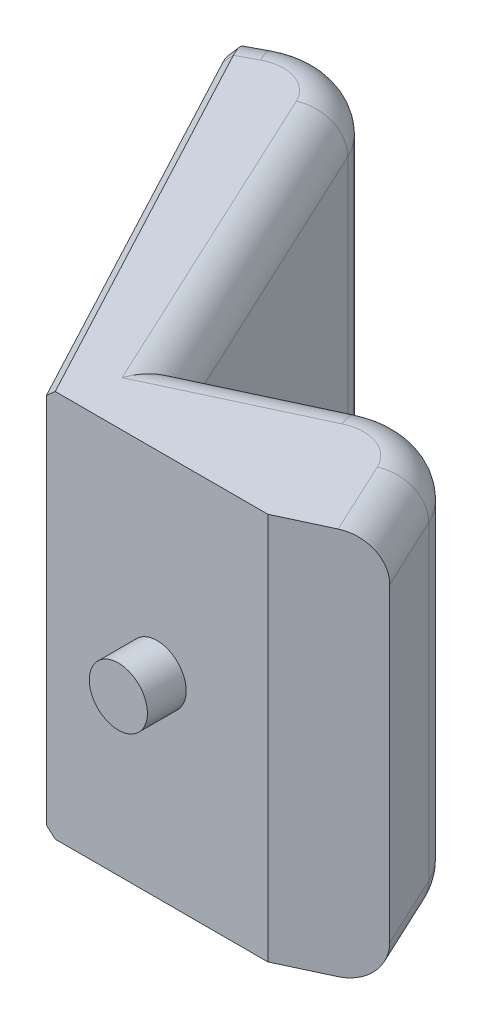
ISO-10303-21;
HEADER;
FILE_DESCRIPTION(('STEP AP214'),'2;1');
FILE_NAME('part.step','',(''),(''),'','','');
FILE_SCHEMA(('AUTOMOTIVE_DESIGN { 1 0 10303 214 1 1 1 1 }'));
ENDSEC;
DATA;
#1=APPLICATION_CONTEXT('core data for automotive mechanical design processes');
#2=APPLICATION_PROTOCOL_DEFINITION('international standard','automotive_design',2000,#1);
#3=PRODUCT_CONTEXT('',#1,'mechanical');
#4=PRODUCT('Part','Part','',(#3));
#5=PRODUCT_RELATED_PRODUCT_CATEGORY('part','',(#4));
#6=PRODUCT_DEFINITION_FORMATION('','',#4);
#7=PRODUCT_DEFINITION_CONTEXT('part definition',#1,'design');
#8=PRODUCT_DEFINITION('design','',#6,#7);
#9=PRODUCT_DEFINITION_SHAPE('','',#8);
#10=(LENGTH_UNIT() NAMED_UNIT(*) SI_UNIT(.MILLI.,.METRE.));
#11=(NAMED_UNIT(*) PLANE_ANGLE_UNIT() SI_UNIT($,.RADIAN.));
#12=(NAMED_UNIT(*) SI_UNIT($,.STERADIAN.) SOLID_ANGLE_UNIT());
#13=UNCERTAINTY_MEASURE_WITH_UNIT(LENGTH_MEASURE(1.E-05),#10,'distance_accuracy_value','');
#14=(GEOMETRIC_REPRESENTATION_CONTEXT(3) GLOBAL_UNCERTAINTY_ASSIGNED_CONTEXT((#13)) GLOBAL_UNIT_ASSIGNED_CONTEXT((#10,
#11,#12)) REPRESENTATION_CONTEXT('',''));
#15=CARTESIAN_POINT('',(0.,0.,0.));
#16=DIRECTION('',(0.,0.,1.));
#17=DIRECTION('',(1.,0.,0.));
#18=AXIS2_PLACEMENT_3D('',#15,#16,#17);
#19=CARTESIAN_POINT('',(-49.9268318921868,50.,-109.36052100333));
#20=DIRECTION('',(0.469329852369791,0.,0.883022927037883));
#21=DIRECTION('',(0.883022927037883,0.,-0.469329852369791));
#22=AXIS2_PLACEMENT_3D('',#19,#20,#21);
#23=PLANE('',#22);
#24=DIRECTION('',(-0.883022927037883,0.,0.469329852369791));
#25=VECTOR('',#24,1.);
#26=CARTESIAN_POINT('',(-49.9268318921868,-40.,-109.36052100333));
#27=LINE('',#26,#25);
#28=CARTESIAN_POINT('',(-49.9268318921868,-40.,-109.36052100333));
#29=VERTEX_POINT('',#28);
#30=CARTESIAN_POINT('',(-54.5535364302991,-40.,-106.901410949286));
#31=VERTEX_POINT('',#30);
#32=EDGE_CURVE('E222',#29,#31,#27,.T.);
#33=ORIENTED_EDGE('',*,*,#32,.T.);
#34=DIRECTION('',(0.,1.,0.));
#35=VECTOR('',#34,1.);
#36=CARTESIAN_POINT('',(-54.5535364302991,50.,-106.901410949286));
#37=LINE('',#36,#35);
#38=CARTESIAN_POINT('',(-54.5535364302991,40.,-106.901410949286));
#39=VERTEX_POINT('',#38);
#40=EDGE_CURVE('E317',#31,#39,#37,.T.);
#41=ORIENTED_EDGE('',*,*,#40,.T.);
#42=DIRECTION('',(-0.883022927037883,0.,0.469329852369791));
#43=VECTOR('',#42,1.);
#44=CARTESIAN_POINT('',(-49.9268318921868,40.,-109.36052100333));
#45=LINE('',#44,#43);
#46=CARTESIAN_POINT('',(-49.9268318921868,40.,-109.36052100333));
#47=VERTEX_POINT('',#46);
#48=EDGE_CURVE('E220',#39,#47,#45,.F.);
#49=ORIENTED_EDGE('',*,*,#48,.T.);
#50=DIRECTION('',(0.,-1.,0.));
#51=VECTOR('',#50,1.);
#52=CARTESIAN_POINT('',(-49.9268318921868,50.,-109.36052100333));
#53=LINE('',#52,#51);
#54=EDGE_CURVE('E192',#47,#29,#53,.T.);
#55=ORIENTED_EDGE('',*,*,#54,.T.);
#56=EDGE_LOOP('',(#33,#41,#49,#55));
#57=FACE_BOUND('',#56,.T.);
#58=ADVANCED_FACE('F32',(#57),#23,.F.);
#59=CARTESIAN_POINT('',(-56.3195822843749,50.,-105.962751244546));
#60=DIRECTION('',(0.883022927037883,0.,-0.469329852369791));
#61=DIRECTION('',(-0.469329852369791,0.,-0.883022927037883));
#62=AXIS2_PLACEMENT_3D('',#59,#60,#61);
#63=PLANE('',#62);
#64=DIRECTION('',(0.,-1.,0.));
#65=VECTOR('',#64,1.);
#66=CARTESIAN_POINT('',(0.,50.,0.));
#67=LINE('',#66,#65);
#68=CARTESIAN_POINT('',(0.,48.,0.));
#69=VERTEX_POINT('',#68);
#70=CARTESIAN_POINT('',(0.,-48.,0.));
#71=VERTEX_POINT('',#70);
#72=EDGE_CURVE('E185',#69,#71,#67,.T.);
#73=ORIENTED_EDGE('',*,*,#72,.F.);
#74=DIRECTION('',(-0.469329852369791,0.,-0.883022927037883));
#75=VECTOR('',#74,1.);
#76=CARTESIAN_POINT('',(-51.626283760677,48.,-97.1325219741671));
#77=LINE('',#76,#75);
#78=CARTESIAN_POINT('',(-51.626283760677,47.9999999999999,-97.1325219741671));
#79=VERTEX_POINT('',#78);
#80=EDGE_CURVE('E313',#69,#79,#77,.T.);
#81=ORIENTED_EDGE('',*,*,#80,.T.);
#82=CARTESIAN_POINT('',(-51.626283760677,40.,-97.1325219741671));
#83=DIRECTION('',(0.883022927037883,0.,-0.469329852369791));
#84=DIRECTION('',(-0.469329852369791,0.,-0.883022927037883));
#85=AXIS2_PLACEMENT_3D('',#82,#83,#84);
#86=CIRCLE('',#85,7.99999999999995);
#87=CARTESIAN_POINT('',(-55.3809225796353,40.,-104.19670539047));
#88=VERTEX_POINT('',#87);
#89=EDGE_CURVE('E311',#79,#88,#86,.F.);
#90=ORIENTED_EDGE('',*,*,#89,.T.);
#91=DIRECTION('',(0.,-1.,0.));
#92=VECTOR('',#91,1.);
#93=CARTESIAN_POINT('',(-55.3809225796353,50.,-104.19670539047));
#94=LINE('',#93,#92);
#95=CARTESIAN_POINT('',(-55.3809225796353,-40.,-104.19670539047));
#96=VERTEX_POINT('',#95);
#97=EDGE_CURVE('E309',#88,#96,#94,.T.);
#98=ORIENTED_EDGE('',*,*,#97,.T.);
#99=CARTESIAN_POINT('',(-51.626283760677,-40.,-97.1325219741671));
#100=DIRECTION('',(0.883022927037883,0.,-0.469329852369791));
#101=DIRECTION('',(-0.469329852369791,0.,-0.883022927037883));
#102=AXIS2_PLACEMENT_3D('',#99,#100,#101);
#103=CIRCLE('',#102,7.99999999999997);
#104=CARTESIAN_POINT('',(-51.626283760677,-48.,-97.1325219741671));
#105=VERTEX_POINT('',#104);
#106=EDGE_CURVE('E305',#96,#105,#103,.F.);
#107=ORIENTED_EDGE('',*,*,#106,.T.);
#108=DIRECTION('',(0.469329852369791,0.,0.883022927037883));
#109=VECTOR('',#108,1.);
#110=CARTESIAN_POINT('',(-56.3195822843749,-48.,-105.962751244546));
#111=LINE('',#110,#109);
#112=EDGE_CURVE('E307',#105,#71,#111,.T.);
#113=ORIENTED_EDGE('',*,*,#112,.T.);
#114=EDGE_LOOP('',(#73,#81,#90,#98,#107,#113));
#115=FACE_BOUND('',#114,.T.);
#116=ADVANCED_FACE('F341',(#115),#63,.F.);
#117=CARTESIAN_POINT('',(0.,50.,0.));
#118=DIRECTION('',(0.,0.,-1.));
#119=DIRECTION('',(-1.,0.,0.));
#120=AXIS2_PLACEMENT_3D('',#117,#118,#119);
#121=PLANE('',#120);
#122=CARTESIAN_POINT('',(28.55,0.,0.));
#123=DIRECTION('',(0.,0.,-1.));
#124=DIRECTION('',(-1.,0.,0.));
#125=AXIS2_PLACEMENT_3D('',#122,#123,#124);
#126=CIRCLE('',#125,7.5);
#127=CARTESIAN_POINT('',(21.05,0.,0.));
#128=VERTEX_POINT('',#127);
#129=EDGE_CURVE('E217',#128,#128,#126,.F.);
#130=ORIENTED_EDGE('',*,*,#129,.F.);
#131=EDGE_LOOP('',(#130));
#132=FACE_BOUND('',#131,.T.);
#133=DIRECTION('',(1.,0.,0.));
#134=VECTOR('',#133,1.);
#135=CARTESIAN_POINT('',(0.,50.,0.));
#136=LINE('',#135,#134);
#137=CARTESIAN_POINT('',(2.26494685331565,50.,0.));
#138=VERTEX_POINT('',#137);
#139=CARTESIAN_POINT('',(57.1,50.,0.));
#140=VERTEX_POINT('',#139);
#141=EDGE_CURVE('E165',#138,#140,#136,.T.);
#142=ORIENTED_EDGE('',*,*,#141,.F.);
#143=DIRECTION('',(-0.749588649437998,-0.66190396330111,0.));
#144=VECTOR('',#143,1.);
#145=CARTESIAN_POINT('',(3.61018174373285,51.1878732504897,0.));
#146=LINE('',#145,#144);
#147=EDGE_CURVE('E303',#138,#69,#146,.T.);
#148=ORIENTED_EDGE('',*,*,#147,.T.);
#149=ORIENTED_EDGE('',*,*,#72,.T.);
#150=DIRECTION('',(-0.749588649437998,0.66190396330111,0.));
#151=VECTOR('',#150,1.);
#152=CARTESIAN_POINT('',(-31.6450239270206,-20.0567183457786,0.));
#153=LINE('',#152,#151);
#154=CARTESIAN_POINT('',(2.26494685331567,-50.,0.));
#155=VERTEX_POINT('',#154);
#156=EDGE_CURVE('E301',#71,#155,#153,.F.);
#157=ORIENTED_EDGE('',*,*,#156,.T.);
#158=DIRECTION('',(1.,0.,0.));
#159=VECTOR('',#158,1.);
#160=CARTESIAN_POINT('',(0.,-50.,0.));
#161=LINE('',#160,#159);
#162=CARTESIAN_POINT('',(57.1,-50.,0.));
#163=VERTEX_POINT('',#162);
#164=EDGE_CURVE('E181',#155,#163,#161,.T.);
#165=ORIENTED_EDGE('',*,*,#164,.T.);
#166=DIRECTION('',(0.,-1.,0.));
#167=VECTOR('',#166,1.);
#168=CARTESIAN_POINT('',(57.1,50.,0.));
#169=LINE('',#168,#167);
#170=EDGE_CURVE('E179',#140,#163,#169,.T.);
#171=ORIENTED_EDGE('',*,*,#170,.F.);
#172=EDGE_LOOP('',(#142,#148,#149,#157,#165,#171));
#173=FACE_BOUND('',#172,.T.);
#174=ADVANCED_FACE('F180',(#132,#173),#121,.F.);
#175=CARTESIAN_POINT('',(57.1,50.,0.));
#176=DIRECTION('',(-0.422618261740701,0.,-0.906307787036649));
#177=DIRECTION('',(-0.906307787036649,0.,0.422618261740701));
#178=AXIS2_PLACEMENT_3D('',#175,#176,#177);
#179=PLANE('',#178);
#180=DIRECTION('',(0.906307787036649,0.,-0.422618261740701));
#181=VECTOR('',#180,1.);
#182=CARTESIAN_POINT('',(57.1,-50.,0.));
#183=LINE('',#182,#181);
#184=CARTESIAN_POINT('',(69.481991334729,-50.,-5.77381738259299));
#185=VERTEX_POINT('',#184);
#186=EDGE_CURVE('E176',#163,#185,#183,.T.);
#187=ORIENTED_EDGE('',*,*,#186,.T.);
#188=CARTESIAN_POINT('',(69.481991334729,-40.,-5.77381738259299));
#189=DIRECTION('',(-0.422618261740701,0.,-0.906307787036649));
#190=DIRECTION('',(-0.906307787036649,0.,0.422618261740701));
#191=AXIS2_PLACEMENT_3D('',#188,#189,#190);
#192=CIRCLE('',#191,10.);
#193=CARTESIAN_POINT('',(78.5450692050955,-40.,-10.));
#194=VERTEX_POINT('',#193);
#195=EDGE_CURVE('E245',#185,#194,#192,.F.);
#196=ORIENTED_EDGE('',*,*,#195,.T.);
#197=DIRECTION('',(0.,-1.,0.));
#198=VECTOR('',#197,1.);
#199=CARTESIAN_POINT('',(78.5450692050955,50.,-10.));
#200=LINE('',#199,#198);
#201=CARTESIAN_POINT('',(78.5450692050955,40.,-10.));
#202=VERTEX_POINT('',#201);
#203=EDGE_CURVE('E186',#202,#194,#200,.T.);
#204=ORIENTED_EDGE('',*,*,#203,.F.);
#205=CARTESIAN_POINT('',(69.481991334729,40.,-5.77381738259299));
#206=DIRECTION('',(-0.422618261740701,0.,-0.906307787036649));
#207=DIRECTION('',(-0.906307787036649,0.,0.422618261740701));
#208=AXIS2_PLACEMENT_3D('',#205,#206,#207);
#209=CIRCLE('',#208,10.);
#210=CARTESIAN_POINT('',(69.481991334729,50.,-5.77381738259299));
#211=VERTEX_POINT('',#210);
#212=EDGE_CURVE('E191',#202,#211,#209,.F.);
#213=ORIENTED_EDGE('',*,*,#212,.T.);
#214=DIRECTION('',(0.906307787036649,0.,-0.422618261740701));
#215=VECTOR('',#214,1.);
#216=CARTESIAN_POINT('',(57.1,50.,0.));
#217=LINE('',#216,#215);
#218=EDGE_CURVE('E171',#140,#211,#217,.T.);
#219=ORIENTED_EDGE('',*,*,#218,.F.);
#220=ORIENTED_EDGE('',*,*,#170,.T.);
#221=EDGE_LOOP('',(#187,#196,#204,#213,#219,#220));
#222=FACE_BOUND('',#221,.T.);
#223=ADVANCED_FACE('F188',(#222),#179,.F.);
#224=CARTESIAN_POINT('',(78.5450692050955,50.,-10.));
#225=DIRECTION('',(-0.906307787036649,0.,0.422618261740701));
#226=DIRECTION('',(0.422618261740701,0.,0.906307787036649));
#227=AXIS2_PLACEMENT_3D('',#224,#225,#226);
#228=PLANE('',#227);
#229=ORIENTED_EDGE('',*,*,#203,.T.);
#230=DIRECTION('',(-0.422618261740701,0.,-0.906307787036649));
#231=VECTOR('',#230,1.);
#232=CARTESIAN_POINT('',(78.5450692050955,-40.,-10.));
#233=LINE('',#232,#231);
#234=CARTESIAN_POINT('',(69.7457164699851,-40.,-28.8702728364488));
#235=VERTEX_POINT('',#234);
#236=EDGE_CURVE('E242',#194,#235,#233,.T.);
#237=ORIENTED_EDGE('',*,*,#236,.T.);
#238=DIRECTION('',(0.,-1.,0.));
#239=VECTOR('',#238,1.);
#240=CARTESIAN_POINT('',(69.7457164699851,50.,-28.8702728364488));
#241=LINE('',#240,#239);
#242=CARTESIAN_POINT('',(69.7457164699851,40.,-28.8702728364488));
#243=VERTEX_POINT('',#242);
#244=EDGE_CURVE('E210',#243,#235,#241,.T.);
#245=ORIENTED_EDGE('',*,*,#244,.F.);
#246=DIRECTION('',(-0.422618261740701,0.,-0.906307787036649));
#247=VECTOR('',#246,1.);
#248=CARTESIAN_POINT('',(78.5450692050955,40.,-10.));
#249=LINE('',#248,#247);
#250=EDGE_CURVE('E240',#243,#202,#249,.F.);
#251=ORIENTED_EDGE('',*,*,#250,.T.);
#252=EDGE_LOOP('',(#229,#237,#245,#251));
#253=FACE_BOUND('',#252,.T.);
#254=ADVANCED_FACE('F403',(#253),#228,.F.);
#255=CARTESIAN_POINT('',(51.0481741294805,50.,-20.1514656543941));
#256=DIRECTION('',(0.,-1.,0.));
#257=DIRECTION('',(0.,0.,-1.));
#258=AXIS2_PLACEMENT_3D('',#255,#256,#257);
#259=CYLINDRICAL_SURFACE('',#258,20.6304553573791);
#260=ORIENTED_EDGE('',*,*,#244,.T.);
#261=CARTESIAN_POINT('',(51.0481741294805,-40.,-20.1514656543941));
#262=DIRECTION('',(0.,1.,0.));
#263=DIRECTION('',(0.,0.,1.));
#264=AXIS2_PLACEMENT_3D('',#261,#262,#263);
#265=CIRCLE('',#264,20.6304553573791);
#266=CARTESIAN_POINT('',(42.3293669474258,-40.,-38.8490079948987));
#267=VERTEX_POINT('',#266);
#268=EDGE_CURVE('E269',#235,#267,#265,.T.);
#269=ORIENTED_EDGE('',*,*,#268,.T.);
#270=DIRECTION('',(0.,-1.,0.));
#271=VECTOR('',#270,1.);
#272=CARTESIAN_POINT('',(42.3293669474258,50.,-38.8490079948987));
#273=LINE('',#272,#271);
#274=CARTESIAN_POINT('',(42.3293669474258,40.,-38.8490079948987));
#275=VERTEX_POINT('',#274);
#276=EDGE_CURVE('E207',#275,#267,#273,.T.);
#277=ORIENTED_EDGE('',*,*,#276,.F.);
#278=CARTESIAN_POINT('',(51.0481741294805,40.,-20.1514656543941));
#279=DIRECTION('',(0.,1.,0.));
#280=DIRECTION('',(0.,0.,1.));
#281=AXIS2_PLACEMENT_3D('',#278,#279,#280);
#282=CIRCLE('',#281,20.6304553573791);
#283=EDGE_CURVE('E267',#275,#243,#282,.F.);
#284=ORIENTED_EDGE('',*,*,#283,.T.);
#285=EDGE_LOOP('',(#260,#269,#277,#284));
#286=FACE_BOUND('',#285,.T.);
#287=ADVANCED_FACE('F406',(#286),#259,.T.);
#288=CARTESIAN_POINT('',(42.3293669474258,50.,-38.8490079948987));
#289=DIRECTION('',(0.422618261740701,0.,0.906307787036649));
#290=DIRECTION('',(0.906307787036649,0.,-0.422618261740701));
#291=AXIS2_PLACEMENT_3D('',#288,#289,#290);
#292=PLANE('',#291);
#293=ORIENTED_EDGE('',*,*,#276,.T.);
#294=DIRECTION('',(-0.906307787036649,0.,0.422618261740701));
#295=VECTOR('',#294,1.);
#296=CARTESIAN_POINT('',(42.3293669474258,-40.,-38.8490079948987));
#297=LINE('',#296,#295);
#298=CARTESIAN_POINT('',(12.6300734601734,-40.,-25.));
#299=VERTEX_POINT('',#298);
#300=EDGE_CURVE('E249',#267,#299,#297,.T.);
#301=ORIENTED_EDGE('',*,*,#300,.T.);
#302=DIRECTION('',(0.,-1.,0.));
#303=VECTOR('',#302,1.);
#304=CARTESIAN_POINT('',(12.6300734601734,50.,-25.));
#305=LINE('',#304,#303);
#306=CARTESIAN_POINT('',(12.6300734601734,40.,-25.));
#307=VERTEX_POINT('',#306);
#308=EDGE_CURVE('E204',#307,#299,#305,.T.);
#309=ORIENTED_EDGE('',*,*,#308,.F.);
#310=DIRECTION('',(-0.906307787036649,0.,0.422618261740701));
#311=VECTOR('',#310,1.);
#312=CARTESIAN_POINT('',(42.3293669474258,40.,-38.8490079948987));
#313=LINE('',#312,#311);
#314=EDGE_CURVE('E247',#307,#275,#313,.F.);
#315=ORIENTED_EDGE('',*,*,#314,.T.);
#316=EDGE_LOOP('',(#293,#301,#309,#315));
#317=FACE_BOUND('',#316,.T.);
#318=ADVANCED_FACE('F410',(#317),#292,.F.);
#319=CARTESIAN_POINT('',(12.6300734601734,50.,-25.));
#320=DIRECTION('',(-0.90630778703665,0.,0.4226182617407));
#321=DIRECTION('',(0.4226182617407,0.,0.90630778703665));
#322=AXIS2_PLACEMENT_3D('',#319,#320,#321);
#323=PLANE('',#322);
#324=ORIENTED_EDGE('',*,*,#308,.T.);
#325=DIRECTION('',(-0.4226182617407,0.,-0.90630778703665));
#326=VECTOR('',#325,1.);
#327=CARTESIAN_POINT('',(12.6300734601734,-40.,-25.));
#328=LINE('',#327,#326);
#329=CARTESIAN_POINT('',(-22.4140791040578,-40.,-100.152427697387));
#330=VERTEX_POINT('',#329);
#331=EDGE_CURVE('E265',#299,#330,#328,.T.);
#332=ORIENTED_EDGE('',*,*,#331,.T.);
#333=DIRECTION('',(0.,-1.,0.));
#334=VECTOR('',#333,1.);
#335=CARTESIAN_POINT('',(-22.4140791040578,50.,-100.152427697387));
#336=LINE('',#335,#334);
#337=CARTESIAN_POINT('',(-22.4140791040578,40.,-100.152427697387));
#338=VERTEX_POINT('',#337);
#339=EDGE_CURVE('E195',#338,#330,#336,.T.);
#340=ORIENTED_EDGE('',*,*,#339,.F.);
#341=DIRECTION('',(-0.4226182617407,0.,-0.90630778703665));
#342=VECTOR('',#341,1.);
#343=CARTESIAN_POINT('',(12.6300734601734,40.,-25.));
#344=LINE('',#343,#342);
#345=EDGE_CURVE('E263',#338,#307,#344,.F.);
#346=ORIENTED_EDGE('',*,*,#345,.T.);
#347=EDGE_LOOP('',(#324,#332,#340,#346));
#348=FACE_BOUND('',#347,.T.);
#349=ADVANCED_FACE('F370',(#348),#323,.F.);
#350=CARTESIAN_POINT('',(-40.5402348447909,50.,-91.7000624625727));
#351=DIRECTION('',(0.,-1.,0.));
#352=DIRECTION('',(0.,0.,-1.));
#353=AXIS2_PLACEMENT_3D('',#350,#351,#352);
#354=CYLINDRICAL_SURFACE('',#353,20.);
#355=ORIENTED_EDGE('',*,*,#339,.T.);
#356=CARTESIAN_POINT('',(-40.5402348447909,-40.,-91.7000624625727));
#357=DIRECTION('',(0.,1.,0.));
#358=DIRECTION('',(0.,0.,1.));
#359=AXIS2_PLACEMENT_3D('',#356,#357,#358);
#360=CIRCLE('',#359,20.);
#361=EDGE_CURVE('E238',#330,#29,#360,.T.);
#362=ORIENTED_EDGE('',*,*,#361,.T.);
#363=ORIENTED_EDGE('',*,*,#54,.F.);
#364=CARTESIAN_POINT('',(-40.5402348447909,40.,-91.7000624625727));
#365=DIRECTION('',(0.,1.,0.));
#366=DIRECTION('',(0.,0.,1.));
#367=AXIS2_PLACEMENT_3D('',#364,#365,#366);
#368=CIRCLE('',#367,20.);
#369=EDGE_CURVE('E236',#47,#338,#368,.F.);
#370=ORIENTED_EDGE('',*,*,#369,.T.);
#371=EDGE_LOOP('',(#355,#362,#363,#370));
#372=FACE_BOUND('',#371,.T.);
#373=ADVANCED_FACE('F367',(#372),#354,.T.);
#374=CARTESIAN_POINT('',(51.0481741294805,50.,-20.1514656543941));
#375=DIRECTION('',(0.,1.,0.));
#376=DIRECTION('',(0.,0.,1.));
#377=AXIS2_PLACEMENT_3D('',#374,#375,#376);
#378=PLANE('',#377);
#379=DIRECTION('',(-0.883022927037883,0.,0.469329852369791));
#380=VECTOR('',#379,1.);
#381=CARTESIAN_POINT('',(-51.626283760677,50.,-97.1325219741671));
#382=LINE('',#381,#380);
#383=CARTESIAN_POINT('',(-45.2335333684889,50.,-100.530291732951));
#384=VERTEX_POINT('',#383);
#385=CARTESIAN_POINT('',(-49.8602379066012,50.,-98.0711816789067));
#386=VERTEX_POINT('',#385);
#387=EDGE_CURVE('E255',#384,#386,#382,.T.);
#388=ORIENTED_EDGE('',*,*,#387,.T.);
#389=DIRECTION('',(0.469329852369791,0.,0.883022927037883));
#390=VECTOR('',#389,1.);
#391=CARTESIAN_POINT('',(1.76604585407579,50.,-0.938659704739597));
#392=LINE('',#391,#390);
#393=EDGE_CURVE('E174',#386,#138,#392,.T.);
#394=ORIENTED_EDGE('',*,*,#393,.T.);
#395=ORIENTED_EDGE('',*,*,#141,.T.);
#396=ORIENTED_EDGE('',*,*,#218,.T.);
#397=DIRECTION('',(-0.422618261740701,0.,-0.906307787036649));
#398=VECTOR('',#397,1.);
#399=CARTESIAN_POINT('',(60.6826385996186,50.,-24.6440902190418));
#400=LINE('',#399,#398);
#401=CARTESIAN_POINT('',(60.6826385996186,50.,-24.6440902190418));
#402=VERTEX_POINT('',#401);
#403=EDGE_CURVE('E261',#211,#402,#400,.T.);
#404=ORIENTED_EDGE('',*,*,#403,.T.);
#405=CARTESIAN_POINT('',(51.0481741294805,50.,-20.1514656543941));
#406=DIRECTION('',(0.,1.,0.));
#407=DIRECTION('',(0.,0.,1.));
#408=AXIS2_PLACEMENT_3D('',#405,#406,#407);
#409=CIRCLE('',#408,10.6304553573791);
#410=CARTESIAN_POINT('',(46.5555495648328,50.,-29.7859301245322));
#411=VERTEX_POINT('',#410);
#412=EDGE_CURVE('E259',#402,#411,#409,.T.);
#413=ORIENTED_EDGE('',*,*,#412,.T.);
#414=DIRECTION('',(-0.906307787036649,0.,0.422618261740701));
#415=VECTOR('',#414,1.);
#416=CARTESIAN_POINT('',(16.8562560775804,50.,-15.9369221296335));
#417=LINE('',#416,#415);
#418=CARTESIAN_POINT('',(7.7931782072139,50.,-11.7107395122265));
#419=VERTEX_POINT('',#418);
#420=EDGE_CURVE('E257',#411,#419,#417,.T.);
#421=ORIENTED_EDGE('',*,*,#420,.T.);
#422=DIRECTION('',(-0.4226182617407,0.,-0.90630778703665));
#423=VECTOR('',#422,1.);
#424=CARTESIAN_POINT('',(-31.4771569744243,50.,-95.9262450799796));
#425=LINE('',#424,#423);
#426=CARTESIAN_POINT('',(-31.4771569744244,50.,-95.9262450799796));
#427=VERTEX_POINT('',#426);
#428=EDGE_CURVE('E251',#419,#427,#425,.T.);
#429=ORIENTED_EDGE('',*,*,#428,.T.);
#430=CARTESIAN_POINT('',(-40.5402348447909,50.,-91.7000624625727));
#431=DIRECTION('',(0.,1.,0.));
#432=DIRECTION('',(0.,0.,1.));
#433=AXIS2_PLACEMENT_3D('',#430,#431,#432);
#434=CIRCLE('',#433,10.);
#435=EDGE_CURVE('E253',#427,#384,#434,.T.);
#436=ORIENTED_EDGE('',*,*,#435,.T.);
#437=EDGE_LOOP('',(#388,#394,#395,#396,#404,#413,#421,#429,#436));
#438=FACE_BOUND('',#437,.T.);
#439=ADVANCED_FACE('F168',(#438),#378,.T.);
#440=CARTESIAN_POINT('',(51.0481741294805,-50.,-20.1514656543941));
#441=DIRECTION('',(0.,1.,0.));
#442=DIRECTION('',(0.,0.,1.));
#443=AXIS2_PLACEMENT_3D('',#440,#441,#442);
#444=PLANE('',#443);
#445=ORIENTED_EDGE('',*,*,#164,.F.);
#446=DIRECTION('',(-0.469329852369791,0.,-0.883022927037883));
#447=VECTOR('',#446,1.);
#448=CARTESIAN_POINT('',(4.65910105833023,-50.,4.5044930409121));
#449=LINE('',#448,#447);
#450=CARTESIAN_POINT('',(-49.8602379066012,-50.,-98.0711816789067));
#451=VERTEX_POINT('',#450);
#452=EDGE_CURVE('E41',#155,#451,#449,.T.);
#453=ORIENTED_EDGE('',*,*,#452,.T.);
#454=DIRECTION('',(-0.883022927037883,0.,0.469329852369791));
#455=VECTOR('',#454,1.);
#456=CARTESIAN_POINT('',(-3.47116483545096,-50.,-122.727140374213));
#457=LINE('',#456,#455);
#458=CARTESIAN_POINT('',(-45.2335333684889,-50.,-100.530291732951));
#459=VERTEX_POINT('',#458);
#460=EDGE_CURVE('E234',#451,#459,#457,.F.);
#461=ORIENTED_EDGE('',*,*,#460,.T.);
#462=CARTESIAN_POINT('',(-40.5402348447909,-50.,-91.7000624625727));
#463=DIRECTION('',(0.,1.,0.));
#464=DIRECTION('',(0.,0.,1.));
#465=AXIS2_PLACEMENT_3D('',#462,#463,#464);
#466=CIRCLE('',#465,10.);
#467=CARTESIAN_POINT('',(-31.4771569744244,-50.,-95.9262450799796));
#468=VERTEX_POINT('',#467);
#469=EDGE_CURVE('E232',#459,#468,#466,.F.);
#470=ORIENTED_EDGE('',*,*,#469,.T.);
#471=DIRECTION('',(-0.4226182617407,0.,-0.90630778703665));
#472=VECTOR('',#471,1.);
#473=CARTESIAN_POINT('',(12.2858027718615,-50.,-2.07627504208837));
#474=LINE('',#473,#472);
#475=CARTESIAN_POINT('',(7.7931782072139,-50.,-11.7107395122265));
#476=VERTEX_POINT('',#475);
#477=EDGE_CURVE('E230',#468,#476,#474,.F.);
#478=ORIENTED_EDGE('',*,*,#477,.T.);
#479=DIRECTION('',(-0.906307787036649,0.,0.422618261740701));
#480=VECTOR('',#479,1.);
#481=CARTESIAN_POINT('',(46.5555495648328,-50.,-29.7859301245322));
#482=LINE('',#481,#480);
#483=CARTESIAN_POINT('',(46.5555495648328,-50.,-29.7859301245322));
#484=VERTEX_POINT('',#483);
#485=EDGE_CURVE('E226',#476,#484,#482,.F.);
#486=ORIENTED_EDGE('',*,*,#485,.T.);
#487=CARTESIAN_POINT('',(51.0481741294805,-50.,-20.1514656543941));
#488=DIRECTION('',(0.,1.,0.));
#489=DIRECTION('',(0.,0.,1.));
#490=AXIS2_PLACEMENT_3D('',#487,#488,#489);
#491=CIRCLE('',#490,10.6304553573791);
#492=CARTESIAN_POINT('',(60.6826385996187,-50.,-24.6440902190418));
#493=VERTEX_POINT('',#492);
#494=EDGE_CURVE('E224',#484,#493,#491,.F.);
#495=ORIENTED_EDGE('',*,*,#494,.T.);
#496=DIRECTION('',(-0.422618261740701,0.,-0.906307787036649));
#497=VECTOR('',#496,1.);
#498=CARTESIAN_POINT('',(60.6826385996186,-50.,-24.6440902190418));
#499=LINE('',#498,#497);
#500=EDGE_CURVE('E228',#493,#185,#499,.F.);
#501=ORIENTED_EDGE('',*,*,#500,.T.);
#502=ORIENTED_EDGE('',*,*,#186,.F.);
#503=EDGE_LOOP('',(#445,#453,#461,#470,#478,#486,#495,#501,#502));
#504=FACE_BOUND('',#503,.T.);
#505=ADVANCED_FACE('F419',(#504),#444,.F.);
#506=CARTESIAN_POINT('',(28.55,0.,10.));
#507=DIRECTION('',(0.,0.,-1.));
#508=DIRECTION('',(-1.,0.,0.));
#509=AXIS2_PLACEMENT_3D('',#506,#507,#508);
#510=CYLINDRICAL_SURFACE('',#509,7.5);
#511=CARTESIAN_POINT('',(28.55,0.,10.));
#512=DIRECTION('',(0.,0.,1.));
#513=DIRECTION('',(1.,0.,0.));
#514=AXIS2_PLACEMENT_3D('',#511,#512,#513);
#515=CIRCLE('',#514,7.5);
#516=CARTESIAN_POINT('',(36.05,0.,10.));
#517=VERTEX_POINT('',#516);
#518=EDGE_CURVE('E200',#517,#517,#515,.T.);
#519=ORIENTED_EDGE('',*,*,#518,.F.);
#520=EDGE_LOOP('',(#519));
#521=FACE_BOUND('',#520,.T.);
#522=ORIENTED_EDGE('',*,*,#129,.T.);
#523=EDGE_LOOP('',(#522));
#524=FACE_BOUND('',#523,.T.);
#525=ADVANCED_FACE('F422',(#521,#524),#510,.T.);
#526=CARTESIAN_POINT('',(28.55,0.,10.));
#527=DIRECTION('',(0.,0.,1.));
#528=DIRECTION('',(1.,0.,0.));
#529=AXIS2_PLACEMENT_3D('',#526,#527,#528);
#530=PLANE('',#529);
#531=ORIENTED_EDGE('',*,*,#518,.T.);
#532=EDGE_LOOP('',(#531));
#533=FACE_BOUND('',#532,.T.);
#534=ADVANCED_FACE('F427',(#533),#530,.T.);
#535=CARTESIAN_POINT('',(69.481991334729,-40.,-5.77381738259299));
#536=DIRECTION('',(-0.422618261740701,0.,-0.906307787036649));
#537=DIRECTION('',(-0.906307787036649,0.,0.422618261740701));
#538=AXIS2_PLACEMENT_3D('',#535,#536,#537);
#539=CYLINDRICAL_SURFACE('',#538,10.);
#540=ORIENTED_EDGE('',*,*,#195,.F.);
#541=ORIENTED_EDGE('',*,*,#500,.F.);
#542=CARTESIAN_POINT('',(60.6826385996186,-40.,-24.6440902190418));
#543=DIRECTION('',(-0.422618261740701,0.,-0.906307787036649));
#544=DIRECTION('',(-0.906307787036649,0.,0.422618261740701));
#545=AXIS2_PLACEMENT_3D('',#542,#543,#544);
#546=CIRCLE('',#545,10.);
#547=EDGE_CURVE('E284',#235,#493,#546,.T.);
#548=ORIENTED_EDGE('',*,*,#547,.F.);
#549=ORIENTED_EDGE('',*,*,#236,.F.);
#550=EDGE_LOOP('',(#540,#541,#548,#549));
#551=FACE_BOUND('',#550,.T.);
#552=ADVANCED_FACE('F430',(#551),#539,.T.);
#553=CARTESIAN_POINT('',(51.0481741294805,-40.,-20.1514656543941));
#554=DIRECTION('',(0.,1.,0.));
#555=DIRECTION('',(0.,0.,1.));
#556=AXIS2_PLACEMENT_3D('',#553,#554,#555);
#557=TOROIDAL_SURFACE('',#556,10.6304553573791,10.);
#558=ORIENTED_EDGE('',*,*,#547,.T.);
#559=ORIENTED_EDGE('',*,*,#494,.F.);
#560=CARTESIAN_POINT('',(46.5555495648328,-40.,-29.7859301245322));
#561=DIRECTION('',(-0.906307787036649,0.,0.422618261740701));
#562=DIRECTION('',(0.422618261740701,0.,0.906307787036649));
#563=AXIS2_PLACEMENT_3D('',#560,#561,#562);
#564=CIRCLE('',#563,10.);
#565=EDGE_CURVE('E281',#267,#484,#564,.T.);
#566=ORIENTED_EDGE('',*,*,#565,.F.);
#567=ORIENTED_EDGE('',*,*,#268,.F.);
#568=EDGE_LOOP('',(#558,#559,#566,#567));
#569=FACE_BOUND('',#568,.T.);
#570=ADVANCED_FACE('F435',(#569),#557,.T.);
#571=CARTESIAN_POINT('',(46.5555495648328,-40.,-29.7859301245322));
#572=DIRECTION('',(-0.906307787036649,0.,0.422618261740701));
#573=DIRECTION('',(0.422618261740701,0.,0.906307787036649));
#574=AXIS2_PLACEMENT_3D('',#571,#572,#573);
#575=CYLINDRICAL_SURFACE('',#574,10.);
#576=ORIENTED_EDGE('',*,*,#565,.T.);
#577=ORIENTED_EDGE('',*,*,#485,.F.);
#578=CARTESIAN_POINT('',(7.7931782072139,-40.,-11.7107395122265));
#579=DIRECTION('',(-0.939692620785909,0.,-0.342020143325668));
#580=DIRECTION('',(-0.342020143325668,0.,0.939692620785909));
#581=AXIS2_PLACEMENT_3D('',#578,#579,#580);
#582=ELLIPSE('',#581,14.142135623731,10.);
#583=EDGE_CURVE('E278',#299,#476,#582,.T.);
#584=ORIENTED_EDGE('',*,*,#583,.F.);
#585=ORIENTED_EDGE('',*,*,#300,.F.);
#586=EDGE_LOOP('',(#576,#577,#584,#585));
#587=FACE_BOUND('',#586,.T.);
#588=ADVANCED_FACE('F445',(#587),#575,.T.);
#589=CARTESIAN_POINT('',(3.56699558980689,-40.,-20.773817382593));
#590=DIRECTION('',(-0.4226182617407,0.,-0.90630778703665));
#591=DIRECTION('',(-0.90630778703665,0.,0.4226182617407));
#592=AXIS2_PLACEMENT_3D('',#589,#590,#591);
#593=CYLINDRICAL_SURFACE('',#592,10.);
#594=ORIENTED_EDGE('',*,*,#583,.T.);
#595=ORIENTED_EDGE('',*,*,#477,.F.);
#596=CARTESIAN_POINT('',(-31.4771569744243,-40.,-95.9262450799796));
#597=DIRECTION('',(-0.4226182617407,0.,-0.90630778703665));
#598=DIRECTION('',(-0.90630778703665,0.,0.4226182617407));
#599=AXIS2_PLACEMENT_3D('',#596,#597,#598);
#600=CIRCLE('',#599,10.);
#601=EDGE_CURVE('E274',#330,#468,#600,.T.);
#602=ORIENTED_EDGE('',*,*,#601,.F.);
#603=ORIENTED_EDGE('',*,*,#331,.F.);
#604=EDGE_LOOP('',(#594,#595,#602,#603));
#605=FACE_BOUND('',#604,.T.);
#606=ADVANCED_FACE('F375',(#605),#593,.T.);
#607=CARTESIAN_POINT('',(-40.5402348447909,-40.,-91.7000624625727));
#608=DIRECTION('',(0.,1.,0.));
#609=DIRECTION('',(0.,0.,1.));
#610=AXIS2_PLACEMENT_3D('',#607,#608,#609);
#611=TOROIDAL_SURFACE('',#610,10.,10.);
#612=ORIENTED_EDGE('',*,*,#601,.T.);
#613=ORIENTED_EDGE('',*,*,#469,.F.);
#614=CARTESIAN_POINT('',(-45.2335333684889,-40.,-100.530291732951));
#615=DIRECTION('',(-0.88302292703788,0.,0.469329852369797));
#616=DIRECTION('',(0.469329852369797,0.,0.88302292703788));
#617=AXIS2_PLACEMENT_3D('',#614,#615,#616);
#618=CIRCLE('',#617,10.);
#619=EDGE_CURVE('E271',#29,#459,#618,.T.);
#620=ORIENTED_EDGE('',*,*,#619,.F.);
#621=ORIENTED_EDGE('',*,*,#361,.F.);
#622=EDGE_LOOP('',(#612,#613,#620,#621));
#623=FACE_BOUND('',#622,.T.);
#624=ADVANCED_FACE('F381',(#623),#611,.T.);
#625=CARTESIAN_POINT('',(-45.2335333684889,-40.,-100.530291732951));
#626=DIRECTION('',(-0.883022927037883,0.,0.469329852369791));
#627=DIRECTION('',(0.469329852369791,0.,0.883022927037883));
#628=AXIS2_PLACEMENT_3D('',#625,#626,#627);
#629=CYLINDRICAL_SURFACE('',#628,10.);
#630=ORIENTED_EDGE('',*,*,#460,.F.);
#631=CARTESIAN_POINT('',(-49.8602379066012,-40.,-98.0711816789067));
#632=DIRECTION('',(0.883022927037882,0.,-0.469329852369792));
#633=DIRECTION('',(-0.469329852369792,0.,-0.883022927037882));
#634=AXIS2_PLACEMENT_3D('',#631,#632,#633);
#635=CIRCLE('',#634,10.);
#636=EDGE_CURVE('E11',#451,#31,#635,.T.);
#637=ORIENTED_EDGE('',*,*,#636,.T.);
#638=ORIENTED_EDGE('',*,*,#32,.F.);
#639=ORIENTED_EDGE('',*,*,#619,.T.);
#640=EDGE_LOOP('',(#630,#637,#638,#639));
#641=FACE_BOUND('',#640,.T.);
#642=ADVANCED_FACE('F382',(#641),#629,.T.);
#643=CARTESIAN_POINT('',(-3.47116483545097,40.,-122.727140374213));
#644=DIRECTION('',(0.883022927037883,0.,-0.469329852369791));
#645=DIRECTION('',(-0.469329852369791,0.,-0.883022927037883));
#646=AXIS2_PLACEMENT_3D('',#643,#644,#645);
#647=CYLINDRICAL_SURFACE('',#646,10.);
#648=ORIENTED_EDGE('',*,*,#48,.F.);
#649=CARTESIAN_POINT('',(-49.8602379066012,40.,-98.0711816789067));
#650=DIRECTION('',(0.883022927037885,0.,-0.469329852369786));
#651=DIRECTION('',(-0.469329852369787,0.,-0.883022927037885));
#652=AXIS2_PLACEMENT_3D('',#649,#650,#651);
#653=CIRCLE('',#652,10.);
#654=EDGE_CURVE('E315',#39,#386,#653,.T.);
#655=ORIENTED_EDGE('',*,*,#654,.T.);
#656=ORIENTED_EDGE('',*,*,#387,.F.);
#657=CARTESIAN_POINT('',(-45.2335333684889,40.,-100.530291732951));
#658=DIRECTION('',(0.883022927037883,0.,-0.469329852369791));
#659=DIRECTION('',(-0.469329852369791,0.,-0.883022927037883));
#660=AXIS2_PLACEMENT_3D('',#657,#658,#659);
#661=CIRCLE('',#660,10.);
#662=EDGE_CURVE('E275',#47,#384,#661,.T.);
#663=ORIENTED_EDGE('',*,*,#662,.F.);
#664=EDGE_LOOP('',(#648,#655,#656,#663));
#665=FACE_BOUND('',#664,.T.);
#666=ADVANCED_FACE('F357',(#665),#647,.T.);
#667=CARTESIAN_POINT('',(-40.5402348447909,40.,-91.7000624625727));
#668=DIRECTION('',(0.,1.,0.));
#669=DIRECTION('',(0.,0.,1.));
#670=AXIS2_PLACEMENT_3D('',#667,#668,#669);
#671=TOROIDAL_SURFACE('',#670,10.,10.);
#672=ORIENTED_EDGE('',*,*,#662,.T.);
#673=ORIENTED_EDGE('',*,*,#435,.F.);
#674=CARTESIAN_POINT('',(-31.4771569744244,40.,-95.9262450799796));
#675=DIRECTION('',(0.422618261740692,0.,0.906307787036653));
#676=DIRECTION('',(0.906307787036653,0.,-0.422618261740693));
#677=AXIS2_PLACEMENT_3D('',#674,#675,#676);
#678=CIRCLE('',#677,10.);
#679=EDGE_CURVE('E295',#338,#427,#678,.T.);
#680=ORIENTED_EDGE('',*,*,#679,.F.);
#681=ORIENTED_EDGE('',*,*,#369,.F.);
#682=EDGE_LOOP('',(#672,#673,#680,#681));
#683=FACE_BOUND('',#682,.T.);
#684=ADVANCED_FACE('F363',(#683),#671,.T.);
#685=CARTESIAN_POINT('',(12.2858027718615,40.,-2.07627504208837));
#686=DIRECTION('',(0.4226182617407,0.,0.90630778703665));
#687=DIRECTION('',(0.90630778703665,0.,-0.4226182617407));
#688=AXIS2_PLACEMENT_3D('',#685,#686,#687);
#689=CYLINDRICAL_SURFACE('',#688,10.);
#690=ORIENTED_EDGE('',*,*,#679,.T.);
#691=ORIENTED_EDGE('',*,*,#428,.F.);
#692=CARTESIAN_POINT('',(7.7931782072139,40.,-11.7107395122265));
#693=DIRECTION('',(0.939692620785909,0.,0.342020143325668));
#694=DIRECTION('',(0.342020143325668,0.,-0.939692620785909));
#695=AXIS2_PLACEMENT_3D('',#692,#693,#694);
#696=ELLIPSE('',#695,14.142135623731,10.);
#697=EDGE_CURVE('E292',#307,#419,#696,.T.);
#698=ORIENTED_EDGE('',*,*,#697,.F.);
#699=ORIENTED_EDGE('',*,*,#345,.F.);
#700=EDGE_LOOP('',(#690,#691,#698,#699));
#701=FACE_BOUND('',#700,.T.);
#702=ADVANCED_FACE('F462',(#701),#689,.T.);
#703=CARTESIAN_POINT('',(46.5555495648328,40.,-29.7859301245322));
#704=DIRECTION('',(0.906307787036649,0.,-0.422618261740701));
#705=DIRECTION('',(-0.422618261740701,0.,-0.906307787036649));
#706=AXIS2_PLACEMENT_3D('',#703,#704,#705);
#707=CYLINDRICAL_SURFACE('',#706,10.);
#708=ORIENTED_EDGE('',*,*,#697,.T.);
#709=ORIENTED_EDGE('',*,*,#420,.F.);
#710=CARTESIAN_POINT('',(46.5555495648328,40.,-29.7859301245322));
#711=DIRECTION('',(0.906307787036649,0.,-0.422618261740701));
#712=DIRECTION('',(-0.422618261740701,0.,-0.906307787036649));
#713=AXIS2_PLACEMENT_3D('',#710,#711,#712);
#714=CIRCLE('',#713,10.);
#715=EDGE_CURVE('E289',#275,#411,#714,.T.);
#716=ORIENTED_EDGE('',*,*,#715,.F.);
#717=ORIENTED_EDGE('',*,*,#314,.F.);
#718=EDGE_LOOP('',(#708,#709,#716,#717));
#719=FACE_BOUND('',#718,.T.);
#720=ADVANCED_FACE('F458',(#719),#707,.T.);
#721=CARTESIAN_POINT('',(51.0481741294805,40.,-20.1514656543941));
#722=DIRECTION('',(0.,1.,0.));
#723=DIRECTION('',(0.,0.,1.));
#724=AXIS2_PLACEMENT_3D('',#721,#722,#723);
#725=TOROIDAL_SURFACE('',#724,10.6304553573791,10.);
#726=ORIENTED_EDGE('',*,*,#715,.T.);
#727=ORIENTED_EDGE('',*,*,#412,.F.);
#728=CARTESIAN_POINT('',(60.6826385996187,40.,-24.6440902190418));
#729=DIRECTION('',(0.422618261740701,0.,0.906307787036649));
#730=DIRECTION('',(0.906307787036649,0.,-0.422618261740701));
#731=AXIS2_PLACEMENT_3D('',#728,#729,#730);
#732=CIRCLE('',#731,10.);
#733=EDGE_CURVE('E287',#243,#402,#732,.T.);
#734=ORIENTED_EDGE('',*,*,#733,.F.);
#735=ORIENTED_EDGE('',*,*,#283,.F.);
#736=EDGE_LOOP('',(#726,#727,#734,#735));
#737=FACE_BOUND('',#736,.T.);
#738=ADVANCED_FACE('F454',(#737),#725,.T.);
#739=CARTESIAN_POINT('',(60.6826385996186,40.,-24.6440902190418));
#740=DIRECTION('',(0.422618261740701,0.,0.906307787036649));
#741=DIRECTION('',(0.906307787036649,0.,-0.422618261740701));
#742=AXIS2_PLACEMENT_3D('',#739,#740,#741);
#743=CYLINDRICAL_SURFACE('',#742,10.);
#744=ORIENTED_EDGE('',*,*,#212,.F.);
#745=ORIENTED_EDGE('',*,*,#250,.F.);
#746=ORIENTED_EDGE('',*,*,#733,.T.);
#747=ORIENTED_EDGE('',*,*,#403,.F.);
#748=EDGE_LOOP('',(#744,#745,#746,#747));
#749=FACE_BOUND('',#748,.T.);
#750=ADVANCED_FACE('F451',(#749),#743,.T.);
#751=CARTESIAN_POINT('',(-56.3195822843749,-48.,-105.962751244546));
#752=DIRECTION('',(0.624391499651679,0.70710678118655,-0.331866321223959));
#753=DIRECTION('',(0.469329852369791,0.,0.883022927037883));
#754=AXIS2_PLACEMENT_3D('',#751,#752,#753);
#755=PLANE('',#754);
#756=ORIENTED_EDGE('',*,*,#156,.F.);
#757=ORIENTED_EDGE('',*,*,#112,.F.);
#758=DIRECTION('',(-0.624391499651681,0.707106781186546,0.331866321223964));
#759=VECTOR('',#758,1.);
#760=CARTESIAN_POINT('',(-49.8602379066012,-50.,-98.0711816789067));
#761=LINE('',#760,#759);
#762=EDGE_CURVE('E36',#451,#105,#761,.T.);
#763=ORIENTED_EDGE('',*,*,#762,.F.);
#764=ORIENTED_EDGE('',*,*,#452,.F.);
#765=EDGE_LOOP('',(#756,#757,#763,#764));
#766=FACE_BOUND('',#765,.T.);
#767=ADVANCED_FACE('F34',(#766),#755,.F.);
#768=CARTESIAN_POINT('',(-51.626283760677,-40.,-97.1325219741671));
#769=DIRECTION('',(0.883022927037882,0.,-0.469329852369792));
#770=DIRECTION('',(-0.469329852369792,0.,-0.883022927037882));
#771=AXIS2_PLACEMENT_3D('',#768,#769,#770);
#772=CONICAL_SURFACE('',#771,7.99999999999997,0.785398163397442);
#773=ORIENTED_EDGE('',*,*,#762,.T.);
#774=ORIENTED_EDGE('',*,*,#106,.F.);
#775=DIRECTION('',(-0.292525178427724,0.,0.95625782087564));
#776=VECTOR('',#775,1.);
#777=CARTESIAN_POINT('',(-54.5535364302991,-40.,-106.901410949286));
#778=LINE('',#777,#776);
#779=EDGE_CURVE('E325',#31,#96,#778,.T.);
#780=ORIENTED_EDGE('',*,*,#779,.F.);
#781=ORIENTED_EDGE('',*,*,#636,.F.);
#782=EDGE_LOOP('',(#773,#774,#780,#781));
#783=FACE_BOUND('',#782,.T.);
#784=ADVANCED_FACE('F335',(#783),#772,.T.);
#785=CARTESIAN_POINT('',(-55.3809225796353,50.,-104.19670539047));
#786=DIRECTION('',(0.95625782087564,0.,0.292525178427724));
#787=DIRECTION('',(0.,-1.,0.));
#788=AXIS2_PLACEMENT_3D('',#785,#786,#787);
#789=PLANE('',#788);
#790=ORIENTED_EDGE('',*,*,#779,.T.);
#791=ORIENTED_EDGE('',*,*,#97,.F.);
#792=DIRECTION('',(-0.292525178427724,0.,0.95625782087564));
#793=VECTOR('',#792,1.);
#794=CARTESIAN_POINT('',(-54.5535364302991,40.,-106.901410949286));
#795=LINE('',#794,#793);
#796=EDGE_CURVE('E323',#39,#88,#795,.T.);
#797=ORIENTED_EDGE('',*,*,#796,.F.);
#798=ORIENTED_EDGE('',*,*,#40,.F.);
#799=EDGE_LOOP('',(#790,#791,#797,#798));
#800=FACE_BOUND('',#799,.T.);
#801=ADVANCED_FACE('F351',(#800),#789,.F.);
#802=CARTESIAN_POINT('',(-51.626283760677,40.,-97.1325219741671));
#803=DIRECTION('',(0.883022927037885,0.,-0.469329852369786));
#804=DIRECTION('',(-0.469329852369787,0.,-0.883022927037885));
#805=AXIS2_PLACEMENT_3D('',#802,#803,#804);
#806=CONICAL_SURFACE('',#805,7.99999999999997,0.785398163397444);
#807=ORIENTED_EDGE('',*,*,#796,.T.);
#808=ORIENTED_EDGE('',*,*,#89,.F.);
#809=DIRECTION('',(-0.624391499651677,-0.707106781186551,0.331866321223962));
#810=VECTOR('',#809,1.);
#811=CARTESIAN_POINT('',(-49.8602379066012,50.,-98.0711816789067));
#812=LINE('',#811,#810);
#813=EDGE_CURVE('E320',#386,#79,#812,.T.);
#814=ORIENTED_EDGE('',*,*,#813,.F.);
#815=ORIENTED_EDGE('',*,*,#654,.F.);
#816=EDGE_LOOP('',(#807,#808,#814,#815));
#817=FACE_BOUND('',#816,.T.);
#818=ADVANCED_FACE('F348',(#817),#806,.T.);
#819=CARTESIAN_POINT('',(4.65910105833023,50.,4.5044930409121));
#820=DIRECTION('',(-0.624391499651679,0.70710678118655,0.331866321223959));
#821=DIRECTION('',(-0.469329852369791,0.,-0.883022927037883));
#822=AXIS2_PLACEMENT_3D('',#819,#820,#821);
#823=PLANE('',#822);
#824=ORIENTED_EDGE('',*,*,#813,.T.);
#825=ORIENTED_EDGE('',*,*,#80,.F.);
#826=ORIENTED_EDGE('',*,*,#147,.F.);
#827=ORIENTED_EDGE('',*,*,#393,.F.);
#828=EDGE_LOOP('',(#824,#825,#826,#827));
#829=FACE_BOUND('',#828,.T.);
#830=ADVANCED_FACE('F344',(#829),#823,.T.);
#831=CLOSED_SHELL('',(#58,#116,#174,#223,#254,#287,#318,#349,#373,#439,#505,#525,#534,#552,#570,
#588,#606,#624,#642,#666,#684,#702,#720,#738,#750,#767,#784,#801,#818,#830));
#832=MANIFOLD_SOLID_BREP('B2',#831);
#833=ADVANCED_BREP_SHAPE_REPRESENTATION('',(#18,#832),#14);
#834=SHAPE_DEFINITION_REPRESENTATION(#9,#833);
ENDSEC;
END-ISO-10303-21;
